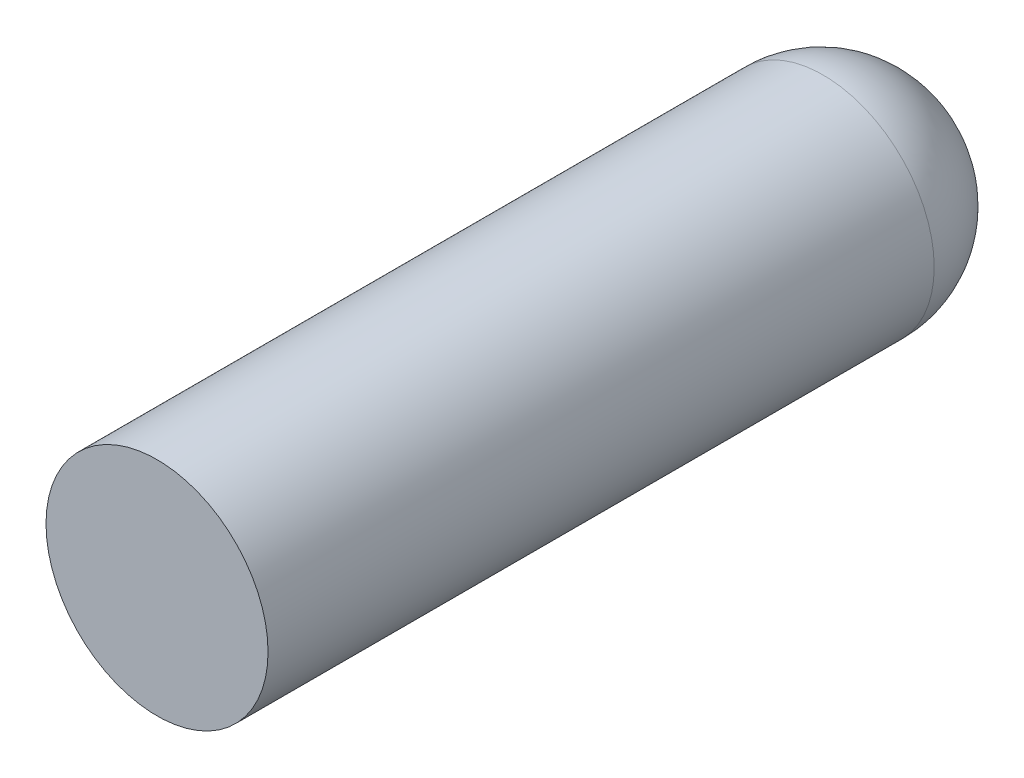
ISO-10303-21;
HEADER;
FILE_DESCRIPTION(('STEP AP214'),'2;1');
FILE_NAME('part.step','',(''),(''),'','','');
FILE_SCHEMA(('AUTOMOTIVE_DESIGN { 1 0 10303 214 1 1 1 1 }'));
ENDSEC;
DATA;
#1=APPLICATION_CONTEXT('core data for automotive mechanical design processes');
#2=APPLICATION_PROTOCOL_DEFINITION('international standard','automotive_design',2000,#1);
#3=PRODUCT_CONTEXT('',#1,'mechanical');
#4=PRODUCT('Part','Part','',(#3));
#5=PRODUCT_RELATED_PRODUCT_CATEGORY('part','',(#4));
#6=PRODUCT_DEFINITION_FORMATION('','',#4);
#7=PRODUCT_DEFINITION_CONTEXT('part definition',#1,'design');
#8=PRODUCT_DEFINITION('design','',#6,#7);
#9=PRODUCT_DEFINITION_SHAPE('','',#8);
#10=(LENGTH_UNIT() NAMED_UNIT(*) SI_UNIT(.MILLI.,.METRE.));
#11=(NAMED_UNIT(*) PLANE_ANGLE_UNIT() SI_UNIT($,.RADIAN.));
#12=(NAMED_UNIT(*) SI_UNIT($,.STERADIAN.) SOLID_ANGLE_UNIT());
#13=UNCERTAINTY_MEASURE_WITH_UNIT(LENGTH_MEASURE(1.E-05),#10,'distance_accuracy_value','');
#14=(GEOMETRIC_REPRESENTATION_CONTEXT(3) GLOBAL_UNCERTAINTY_ASSIGNED_CONTEXT((#13)) GLOBAL_UNIT_ASSIGNED_CONTEXT((#10,
#11,#12)) REPRESENTATION_CONTEXT('',''));
#15=CARTESIAN_POINT('',(0.,0.,0.));
#16=DIRECTION('',(0.,0.,1.));
#17=DIRECTION('',(1.,0.,0.));
#18=AXIS2_PLACEMENT_3D('',#15,#16,#17);
#19=CARTESIAN_POINT('',(0.,0.,-2.));
#20=DIRECTION('',(0.,0.,-1.));
#21=DIRECTION('',(0.,-1.,0.));
#22=AXIS2_PLACEMENT_3D('',#19,#20,#21);
#23=PLANE('',#22);
#24=CARTESIAN_POINT('',(0.,0.,-2.));
#25=DIRECTION('',(0.,0.,-1.));
#26=DIRECTION('',(1.,0.,0.));
#27=AXIS2_PLACEMENT_3D('',#24,#25,#26);
#28=CIRCLE('',#27,1.05);
#29=CARTESIAN_POINT('',(-1.05,0.,-2.));
#30=VERTEX_POINT('',#29);
#31=EDGE_CURVE('E11',#30,#30,#28,.T.);
#32=ORIENTED_EDGE('',*,*,#31,.F.);
#33=EDGE_LOOP('',(#32));
#34=FACE_BOUND('',#33,.T.);
#35=ADVANCED_FACE('F17',(#34),#23,.F.);
#36=CARTESIAN_POINT('',(0.,0.,-9.3));
#37=DIRECTION('',(0.,0.,-1.));
#38=DIRECTION('',(0.,-1.,0.));
#39=AXIS2_PLACEMENT_3D('',#36,#37,#38);
#40=PLANE('',#39);
#41=CARTESIAN_POINT('',(0.,0.,-9.3));
#42=DIRECTION('',(0.,0.,1.));
#43=DIRECTION('',(1.,0.,0.));
#44=AXIS2_PLACEMENT_3D('',#41,#42,#43);
#45=CIRCLE('',#44,0.05);
#46=CARTESIAN_POINT('',(0.05,0.,-9.3));
#47=VERTEX_POINT('',#46);
#48=EDGE_CURVE('E58',#47,#47,#45,.T.);
#49=ORIENTED_EDGE('',*,*,#48,.F.);
#50=EDGE_LOOP('',(#49));
#51=FACE_BOUND('',#50,.T.);
#52=ADVANCED_FACE('F19',(#51),#40,.T.);
#53=CARTESIAN_POINT('',(0.,0.,-2.));
#54=DIRECTION('',(0.,0.,-1.));
#55=DIRECTION('',(1.,0.,0.));
#56=AXIS2_PLACEMENT_3D('',#53,#54,#55);
#57=CYLINDRICAL_SURFACE('',#56,1.05);
#58=CARTESIAN_POINT('',(0.,0.,-8.3));
#59=DIRECTION('',(0.,0.,-1.));
#60=DIRECTION('',(1.,0.,0.));
#61=AXIS2_PLACEMENT_3D('',#58,#59,#60);
#62=CIRCLE('',#61,1.05);
#63=CARTESIAN_POINT('',(-1.05,0.,-8.3));
#64=VERTEX_POINT('',#63);
#65=CARTESIAN_POINT('',(1.05,0.,-8.3));
#66=VERTEX_POINT('',#65);
#67=EDGE_CURVE('E21',#64,#66,#62,.T.);
#68=ORIENTED_EDGE('',*,*,#67,.F.);
#69=DIRECTION('',(0.,0.,1.));
#70=VECTOR('',#69,1.);
#71=CARTESIAN_POINT('',(-1.05,0.,-2.));
#72=LINE('',#71,#70);
#73=EDGE_CURVE('E28',#64,#30,#72,.T.);
#74=ORIENTED_EDGE('',*,*,#73,.T.);
#75=ORIENTED_EDGE('',*,*,#31,.T.);
#76=ORIENTED_EDGE('',*,*,#73,.F.);
#77=CARTESIAN_POINT('',(0.,0.,-8.3));
#78=DIRECTION('',(0.,0.,-1.));
#79=DIRECTION('',(1.,0.,0.));
#80=AXIS2_PLACEMENT_3D('',#77,#78,#79);
#81=CIRCLE('',#80,1.05);
#82=EDGE_CURVE('E60',#66,#64,#81,.T.);
#83=ORIENTED_EDGE('',*,*,#82,.F.);
#84=EDGE_LOOP('',(#68,#74,#75,#76,#83));
#85=FACE_BOUND('',#84,.T.);
#86=ADVANCED_FACE('F97',(#85),#57,.T.);
#87=CARTESIAN_POINT('',(1.05,0.,-8.3));
#88=CARTESIAN_POINT('',(1.05,-1.05,-8.3));
#89=CARTESIAN_POINT('',(0.,-1.05,-8.3));
#90=CARTESIAN_POINT('',(-1.05,-1.05,-8.3));
#91=CARTESIAN_POINT('',(-1.05,0.,-8.3));
#92=CARTESIAN_POINT('',(-1.05,1.05,-8.3));
#93=CARTESIAN_POINT('',(0.,1.05,-8.3));
#94=CARTESIAN_POINT('',(1.05,1.05,-8.3));
#95=CARTESIAN_POINT('',(1.05,0.,-8.3));
#96=CARTESIAN_POINT('',(1.05,0.,-9.3));
#97=CARTESIAN_POINT('',(1.05,-1.05,-9.3));
#98=CARTESIAN_POINT('',(0.,-1.05,-9.3));
#99=CARTESIAN_POINT('',(-1.05,-1.05,-9.3));
#100=CARTESIAN_POINT('',(-1.05,0.,-9.3));
#101=CARTESIAN_POINT('',(-1.05,1.05,-9.3));
#102=CARTESIAN_POINT('',(0.,1.05,-9.3));
#103=CARTESIAN_POINT('',(1.05,1.05,-9.3));
#104=CARTESIAN_POINT('',(1.05,0.,-9.3));
#105=CARTESIAN_POINT('',(0.05,0.,-9.3));
#106=CARTESIAN_POINT('',(0.0500000000000001,-0.0500000000000001,-9.3));
#107=CARTESIAN_POINT('',(0.,-0.05,-9.3));
#108=CARTESIAN_POINT('',(-0.0500000000000001,-0.0500000000000001,-9.3));
#109=CARTESIAN_POINT('',(-0.05,0.,-9.3));
#110=CARTESIAN_POINT('',(-0.0500000000000001,0.0500000000000001,-9.3));
#111=CARTESIAN_POINT('',(0.,0.05,-9.3));
#112=CARTESIAN_POINT('',(0.0500000000000001,0.0500000000000001,-9.3));
#113=CARTESIAN_POINT('',(0.05,0.,-9.3));
#114=(BOUNDED_SURFACE() B_SPLINE_SURFACE(2,2,((#87,#88,#89,#90,#91,#92,#93,#94,#95),(#96,#97,
#98,#99,#100,#101,#102,#103,#104),(#105,#106,#107,#108,#109,#110,#111,#112,#113)),.UNSPECIFIED.,
.F.,.T.,.F.) B_SPLINE_SURFACE_WITH_KNOTS((3,3),(3,2,2,2,3),(0.,1.5707963267949),
(-3.14159265358979,-1.5707963267949,0.,1.5707963267949,3.14159265358979),
.UNSPECIFIED.) GEOMETRIC_REPRESENTATION_ITEM() RATIONAL_B_SPLINE_SURFACE(((1.,0.707106781186548,
1.,0.707106781186548,1.,0.707106781186548,1.,0.707106781186548,1.),(0.707106781186547,0.5,
0.707106781186547,0.5,0.707106781186547,0.5,0.707106781186547,0.5,0.707106781186547),(1.,
0.707106781186548,1.,0.707106781186548,1.,0.707106781186548,1.,0.707106781186548,1.))) REPRESENTATION_ITEM('') SURFACE());
#115=CARTESIAN_POINT('',(0.05,0.,-8.3));
#116=DIRECTION('',(0.,-1.,0.));
#117=DIRECTION('',(1.,0.,0.));
#118=AXIS2_PLACEMENT_3D('',#115,#116,#117);
#119=CIRCLE('',#118,1.);
#120=EDGE_CURVE('E55',#47,#66,#119,.T.);
#121=ORIENTED_EDGE('',*,*,#48,.T.);
#122=ORIENTED_EDGE('',*,*,#120,.T.);
#123=ORIENTED_EDGE('',*,*,#82,.T.);
#124=ORIENTED_EDGE('',*,*,#67,.T.);
#125=ORIENTED_EDGE('',*,*,#120,.F.);
#126=EDGE_LOOP('',(#121,#122,#123,#124,#125));
#127=FACE_BOUND('',#126,.T.);
#128=ADVANCED_FACE('F56',(#127),#114,.F.);
#129=CLOSED_SHELL('',(#35,#52,#86,#128));
#130=MANIFOLD_SOLID_BREP('B1',#129);
#131=ADVANCED_BREP_SHAPE_REPRESENTATION('',(#18,#130),#14);
#132=SHAPE_DEFINITION_REPRESENTATION(#9,#131);
ENDSEC;
END-ISO-10303-21;
